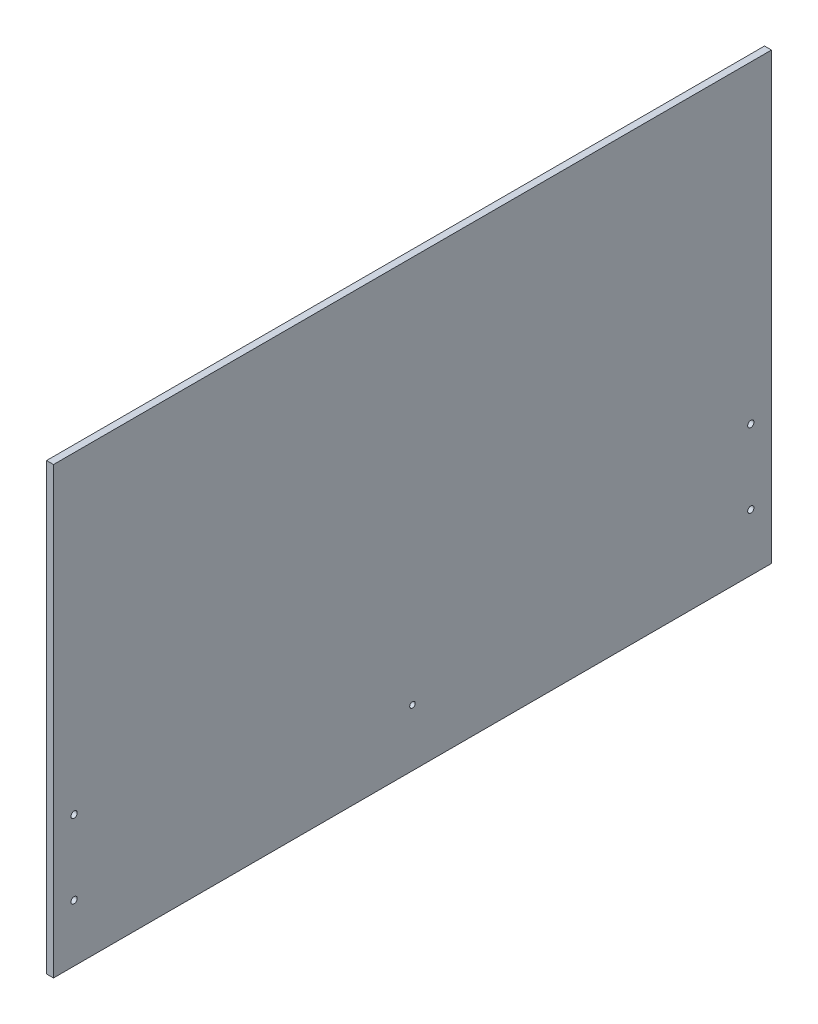
ISO-10303-21;
HEADER;
FILE_DESCRIPTION(('STEP AP214'),'2;1');
FILE_NAME('part.step','',(''),(''),'','','');
FILE_SCHEMA(('AUTOMOTIVE_DESIGN { 1 0 10303 214 1 1 1 1 }'));
ENDSEC;
DATA;
#1=APPLICATION_CONTEXT('core data for automotive mechanical design processes');
#2=APPLICATION_PROTOCOL_DEFINITION('international standard','automotive_design',2000,#1);
#3=PRODUCT_CONTEXT('',#1,'mechanical');
#4=PRODUCT('Part','Part','',(#3));
#5=PRODUCT_RELATED_PRODUCT_CATEGORY('part','',(#4));
#6=PRODUCT_DEFINITION_FORMATION('','',#4);
#7=PRODUCT_DEFINITION_CONTEXT('part definition',#1,'design');
#8=PRODUCT_DEFINITION('design','',#6,#7);
#9=PRODUCT_DEFINITION_SHAPE('','',#8);
#10=(LENGTH_UNIT() NAMED_UNIT(*) SI_UNIT(.MILLI.,.METRE.));
#11=(NAMED_UNIT(*) PLANE_ANGLE_UNIT() SI_UNIT($,.RADIAN.));
#12=(NAMED_UNIT(*) SI_UNIT($,.STERADIAN.) SOLID_ANGLE_UNIT());
#13=UNCERTAINTY_MEASURE_WITH_UNIT(LENGTH_MEASURE(1.E-05),#10,'distance_accuracy_value','');
#14=(GEOMETRIC_REPRESENTATION_CONTEXT(3) GLOBAL_UNCERTAINTY_ASSIGNED_CONTEXT((#13)) GLOBAL_UNIT_ASSIGNED_CONTEXT((#10,
#11,#12)) REPRESENTATION_CONTEXT('',''));
#15=CARTESIAN_POINT('',(0.,0.,0.));
#16=DIRECTION('',(0.,0.,1.));
#17=DIRECTION('',(1.,0.,0.));
#18=AXIS2_PLACEMENT_3D('',#15,#16,#17);
#19=CARTESIAN_POINT('',(4.7625,-152.4,-246.0625));
#20=DIRECTION('',(0.,0.,1.));
#21=DIRECTION('',(1.,0.,0.));
#22=AXIS2_PLACEMENT_3D('',#19,#20,#21);
#23=PLANE('',#22);
#24=DIRECTION('',(0.,1.,0.));
#25=VECTOR('',#24,1.);
#26=CARTESIAN_POINT('',(0.,-152.4,-246.0625));
#27=LINE('',#26,#25);
#28=CARTESIAN_POINT('',(0.,-152.4,-246.0625));
#29=VERTEX_POINT('',#28);
#30=CARTESIAN_POINT('',(0.,152.4,-246.0625));
#31=VERTEX_POINT('',#30);
#32=EDGE_CURVE('E99',#29,#31,#27,.T.);
#33=ORIENTED_EDGE('',*,*,#32,.T.);
#34=DIRECTION('',(-1.,0.,0.));
#35=VECTOR('',#34,1.);
#36=CARTESIAN_POINT('',(4.7625,152.4,-246.0625));
#37=LINE('',#36,#35);
#38=CARTESIAN_POINT('',(4.7625,152.4,-246.0625));
#39=VERTEX_POINT('',#38);
#40=EDGE_CURVE('E11',#39,#31,#37,.T.);
#41=ORIENTED_EDGE('',*,*,#40,.F.);
#42=DIRECTION('',(0.,1.,0.));
#43=VECTOR('',#42,1.);
#44=CARTESIAN_POINT('',(4.7625,-152.4,-246.0625));
#45=LINE('',#44,#43);
#46=CARTESIAN_POINT('',(4.7625,-152.4,-246.0625));
#47=VERTEX_POINT('',#46);
#48=EDGE_CURVE('E86',#47,#39,#45,.T.);
#49=ORIENTED_EDGE('',*,*,#48,.F.);
#50=DIRECTION('',(-1.,0.,0.));
#51=VECTOR('',#50,1.);
#52=CARTESIAN_POINT('',(4.7625,-152.4,-246.0625));
#53=LINE('',#52,#51);
#54=EDGE_CURVE('E95',#47,#29,#53,.T.);
#55=ORIENTED_EDGE('',*,*,#54,.T.);
#56=EDGE_LOOP('',(#33,#41,#49,#55));
#57=FACE_BOUND('',#56,.T.);
#58=ADVANCED_FACE('F33',(#57),#23,.F.);
#59=CARTESIAN_POINT('',(4.7625,152.4,246.0625));
#60=DIRECTION('',(0.,-1.,0.));
#61=DIRECTION('',(0.,0.,-1.));
#62=AXIS2_PLACEMENT_3D('',#59,#60,#61);
#63=PLANE('',#62);
#64=DIRECTION('',(0.,0.,1.));
#65=VECTOR('',#64,1.);
#66=CARTESIAN_POINT('',(0.,152.4,246.0625));
#67=LINE('',#66,#65);
#68=CARTESIAN_POINT('',(0.,152.4,246.0625));
#69=VERTEX_POINT('',#68);
#70=EDGE_CURVE('E90',#31,#69,#67,.T.);
#71=ORIENTED_EDGE('',*,*,#70,.T.);
#72=DIRECTION('',(-1.,0.,0.));
#73=VECTOR('',#72,1.);
#74=CARTESIAN_POINT('',(4.7625,152.4,246.0625));
#75=LINE('',#74,#73);
#76=CARTESIAN_POINT('',(4.7625,152.4,246.0625));
#77=VERTEX_POINT('',#76);
#78=EDGE_CURVE('E42',#77,#69,#75,.T.);
#79=ORIENTED_EDGE('',*,*,#78,.F.);
#80=DIRECTION('',(0.,0.,1.));
#81=VECTOR('',#80,1.);
#82=CARTESIAN_POINT('',(4.7625,152.4,246.0625));
#83=LINE('',#82,#81);
#84=EDGE_CURVE('E81',#39,#77,#83,.T.);
#85=ORIENTED_EDGE('',*,*,#84,.F.);
#86=ORIENTED_EDGE('',*,*,#40,.T.);
#87=EDGE_LOOP('',(#71,#79,#85,#86));
#88=FACE_BOUND('',#87,.T.);
#89=ADVANCED_FACE('F89',(#88),#63,.F.);
#90=CARTESIAN_POINT('',(4.7625,-152.4,246.0625));
#91=DIRECTION('',(0.,0.,-1.));
#92=DIRECTION('',(-1.,0.,0.));
#93=AXIS2_PLACEMENT_3D('',#90,#91,#92);
#94=PLANE('',#93);
#95=DIRECTION('',(0.,-1.,0.));
#96=VECTOR('',#95,1.);
#97=CARTESIAN_POINT('',(0.,-152.4,246.0625));
#98=LINE('',#97,#96);
#99=CARTESIAN_POINT('',(0.,-152.4,246.0625));
#100=VERTEX_POINT('',#99);
#101=EDGE_CURVE('E68',#69,#100,#98,.T.);
#102=ORIENTED_EDGE('',*,*,#101,.T.);
#103=DIRECTION('',(-1.,0.,0.));
#104=VECTOR('',#103,1.);
#105=CARTESIAN_POINT('',(4.7625,-152.4,246.0625));
#106=LINE('',#105,#104);
#107=CARTESIAN_POINT('',(4.7625,-152.4,246.0625));
#108=VERTEX_POINT('',#107);
#109=EDGE_CURVE('E91',#108,#100,#106,.T.);
#110=ORIENTED_EDGE('',*,*,#109,.F.);
#111=DIRECTION('',(0.,-1.,0.));
#112=VECTOR('',#111,1.);
#113=CARTESIAN_POINT('',(4.7625,-152.4,246.0625));
#114=LINE('',#113,#112);
#115=EDGE_CURVE('E84',#77,#108,#114,.T.);
#116=ORIENTED_EDGE('',*,*,#115,.F.);
#117=ORIENTED_EDGE('',*,*,#78,.T.);
#118=EDGE_LOOP('',(#102,#110,#116,#117));
#119=FACE_BOUND('',#118,.T.);
#120=ADVANCED_FACE('F93',(#119),#94,.F.);
#121=CARTESIAN_POINT('',(4.7625,-152.4,246.0625));
#122=DIRECTION('',(0.,1.,0.));
#123=DIRECTION('',(0.,0.,1.));
#124=AXIS2_PLACEMENT_3D('',#121,#122,#123);
#125=PLANE('',#124);
#126=DIRECTION('',(0.,0.,-1.));
#127=VECTOR('',#126,1.);
#128=CARTESIAN_POINT('',(0.,-152.4,246.0625));
#129=LINE('',#128,#127);
#130=EDGE_CURVE('E74',#100,#29,#129,.T.);
#131=ORIENTED_EDGE('',*,*,#130,.T.);
#132=ORIENTED_EDGE('',*,*,#54,.F.);
#133=DIRECTION('',(0.,0.,-1.));
#134=VECTOR('',#133,1.);
#135=CARTESIAN_POINT('',(4.7625,-152.4,246.0625));
#136=LINE('',#135,#134);
#137=EDGE_CURVE('E51',#108,#47,#136,.T.);
#138=ORIENTED_EDGE('',*,*,#137,.F.);
#139=ORIENTED_EDGE('',*,*,#109,.T.);
#140=EDGE_LOOP('',(#131,#132,#138,#139));
#141=FACE_BOUND('',#140,.T.);
#142=ADVANCED_FACE('F143',(#141),#125,.F.);
#143=CARTESIAN_POINT('',(4.7625,0.,0.));
#144=DIRECTION('',(-1.,0.,0.));
#145=DIRECTION('',(0.,0.,1.));
#146=AXIS2_PLACEMENT_3D('',#143,#144,#145);
#147=PLANE('',#146);
#148=CARTESIAN_POINT('',(4.7625,-113.284,0.));
#149=DIRECTION('',(1.,0.,0.));
#150=DIRECTION('',(0.,0.,-1.));
#151=AXIS2_PLACEMENT_3D('',#148,#149,#150);
#152=CIRCLE('',#151,1.89865);
#153=CARTESIAN_POINT('',(4.7625,-113.284,-1.89865000000006));
#154=VERTEX_POINT('',#153);
#155=EDGE_CURVE('E238',#154,#154,#152,.T.);
#156=ORIENTED_EDGE('',*,*,#155,.F.);
#157=EDGE_LOOP('',(#156));
#158=FACE_BOUND('',#157,.T.);
#159=CARTESIAN_POINT('',(4.7625,-113.284,231.93375));
#160=DIRECTION('',(1.,0.,0.));
#161=DIRECTION('',(0.,0.,-1.));
#162=AXIS2_PLACEMENT_3D('',#159,#160,#161);
#163=CIRCLE('',#162,2.15264999999999);
#164=CARTESIAN_POINT('',(4.7625,-113.284,229.7811));
#165=VERTEX_POINT('',#164);
#166=EDGE_CURVE('E124',#165,#165,#163,.T.);
#167=ORIENTED_EDGE('',*,*,#166,.F.);
#168=EDGE_LOOP('',(#167));
#169=FACE_BOUND('',#168,.T.);
#170=CARTESIAN_POINT('',(4.7625,-62.484,231.93375));
#171=DIRECTION('',(1.,0.,0.));
#172=DIRECTION('',(0.,0.,-1.));
#173=AXIS2_PLACEMENT_3D('',#170,#171,#172);
#174=CIRCLE('',#173,2.15264999999999);
#175=CARTESIAN_POINT('',(4.7625,-62.484,229.7811));
#176=VERTEX_POINT('',#175);
#177=EDGE_CURVE('E114',#176,#176,#174,.T.);
#178=ORIENTED_EDGE('',*,*,#177,.F.);
#179=EDGE_LOOP('',(#178));
#180=FACE_BOUND('',#179,.T.);
#181=CARTESIAN_POINT('',(4.7625,-62.484,-231.93375));
#182=DIRECTION('',(1.,0.,0.));
#183=DIRECTION('',(0.,0.,-1.));
#184=AXIS2_PLACEMENT_3D('',#181,#182,#183);
#185=CIRCLE('',#184,2.15264999999999);
#186=CARTESIAN_POINT('',(4.7625,-62.484,-234.0864));
#187=VERTEX_POINT('',#186);
#188=EDGE_CURVE('E111',#187,#187,#185,.T.);
#189=ORIENTED_EDGE('',*,*,#188,.F.);
#190=EDGE_LOOP('',(#189));
#191=FACE_BOUND('',#190,.T.);
#192=CARTESIAN_POINT('',(4.7625,-113.284,-231.93375));
#193=DIRECTION('',(1.,0.,0.));
#194=DIRECTION('',(0.,0.,-1.));
#195=AXIS2_PLACEMENT_3D('',#192,#193,#194);
#196=CIRCLE('',#195,2.15264999999999);
#197=CARTESIAN_POINT('',(4.7625,-113.284,-234.0864));
#198=VERTEX_POINT('',#197);
#199=EDGE_CURVE('E110',#198,#198,#196,.T.);
#200=ORIENTED_EDGE('',*,*,#199,.F.);
#201=EDGE_LOOP('',(#200));
#202=FACE_BOUND('',#201,.T.);
#203=ORIENTED_EDGE('',*,*,#48,.T.);
#204=ORIENTED_EDGE('',*,*,#84,.T.);
#205=ORIENTED_EDGE('',*,*,#115,.T.);
#206=ORIENTED_EDGE('',*,*,#137,.T.);
#207=EDGE_LOOP('',(#203,#204,#205,#206));
#208=FACE_BOUND('',#207,.T.);
#209=ADVANCED_FACE('F82',(#158,#169,#180,#191,#202,#208),#147,.F.);
#210=CARTESIAN_POINT('',(0.,0.,0.));
#211=DIRECTION('',(-1.,0.,0.));
#212=DIRECTION('',(0.,0.,1.));
#213=AXIS2_PLACEMENT_3D('',#210,#211,#212);
#214=PLANE('',#213);
#215=CARTESIAN_POINT('',(0.,-113.284,0.));
#216=DIRECTION('',(-1.,0.,0.));
#217=DIRECTION('',(0.,0.,1.));
#218=AXIS2_PLACEMENT_3D('',#215,#216,#217);
#219=CIRCLE('',#218,1.89865);
#220=CARTESIAN_POINT('',(0.,-113.284,1.89864999999995));
#221=VERTEX_POINT('',#220);
#222=EDGE_CURVE('E235',#221,#221,#219,.T.);
#223=ORIENTED_EDGE('',*,*,#222,.F.);
#224=EDGE_LOOP('',(#223));
#225=FACE_BOUND('',#224,.T.);
#226=CARTESIAN_POINT('',(0.,-113.284,231.93375));
#227=DIRECTION('',(-1.,0.,0.));
#228=DIRECTION('',(0.,0.,1.));
#229=AXIS2_PLACEMENT_3D('',#226,#227,#228);
#230=CIRCLE('',#229,2.15264999999999);
#231=CARTESIAN_POINT('',(0.,-113.284,234.0864));
#232=VERTEX_POINT('',#231);
#233=EDGE_CURVE('E36',#232,#232,#230,.T.);
#234=ORIENTED_EDGE('',*,*,#233,.F.);
#235=EDGE_LOOP('',(#234));
#236=FACE_BOUND('',#235,.T.);
#237=CARTESIAN_POINT('',(0.,-62.484,231.93375));
#238=DIRECTION('',(-1.,0.,0.));
#239=DIRECTION('',(0.,0.,1.));
#240=AXIS2_PLACEMENT_3D('',#237,#238,#239);
#241=CIRCLE('',#240,2.15264999999999);
#242=CARTESIAN_POINT('',(0.,-62.484,234.0864));
#243=VERTEX_POINT('',#242);
#244=EDGE_CURVE('E112',#243,#243,#241,.T.);
#245=ORIENTED_EDGE('',*,*,#244,.F.);
#246=EDGE_LOOP('',(#245));
#247=FACE_BOUND('',#246,.T.);
#248=CARTESIAN_POINT('',(0.,-62.484,-231.93375));
#249=DIRECTION('',(-1.,0.,0.));
#250=DIRECTION('',(0.,0.,1.));
#251=AXIS2_PLACEMENT_3D('',#248,#249,#250);
#252=CIRCLE('',#251,2.15264999999999);
#253=CARTESIAN_POINT('',(0.,-62.484,-229.7811));
#254=VERTEX_POINT('',#253);
#255=EDGE_CURVE('E108',#254,#254,#252,.T.);
#256=ORIENTED_EDGE('',*,*,#255,.F.);
#257=EDGE_LOOP('',(#256));
#258=FACE_BOUND('',#257,.T.);
#259=CARTESIAN_POINT('',(0.,-113.284,-231.93375));
#260=DIRECTION('',(-1.,0.,0.));
#261=DIRECTION('',(0.,0.,1.));
#262=AXIS2_PLACEMENT_3D('',#259,#260,#261);
#263=CIRCLE('',#262,2.15264999999999);
#264=CARTESIAN_POINT('',(0.,-113.284,-229.7811));
#265=VERTEX_POINT('',#264);
#266=EDGE_CURVE('E102',#265,#265,#263,.T.);
#267=ORIENTED_EDGE('',*,*,#266,.F.);
#268=EDGE_LOOP('',(#267));
#269=FACE_BOUND('',#268,.T.);
#270=ORIENTED_EDGE('',*,*,#32,.F.);
#271=ORIENTED_EDGE('',*,*,#130,.F.);
#272=ORIENTED_EDGE('',*,*,#101,.F.);
#273=ORIENTED_EDGE('',*,*,#70,.F.);
#274=EDGE_LOOP('',(#270,#271,#272,#273));
#275=FACE_BOUND('',#274,.T.);
#276=ADVANCED_FACE('F136',(#225,#236,#247,#258,#269,#275),#214,.T.);
#277=CARTESIAN_POINT('',(4.7625,-113.284,-231.93375));
#278=DIRECTION('',(1.,0.,0.));
#279=DIRECTION('',(0.,0.,-1.));
#280=AXIS2_PLACEMENT_3D('',#277,#278,#279);
#281=CYLINDRICAL_SURFACE('',#280,2.15264999999999);
#282=ORIENTED_EDGE('',*,*,#266,.T.);
#283=EDGE_LOOP('',(#282));
#284=FACE_BOUND('',#283,.T.);
#285=ORIENTED_EDGE('',*,*,#199,.T.);
#286=EDGE_LOOP('',(#285));
#287=FACE_BOUND('',#286,.T.);
#288=ADVANCED_FACE('F133',(#284,#287),#281,.F.);
#289=CARTESIAN_POINT('',(4.7625,-62.484,-231.93375));
#290=DIRECTION('',(1.,0.,0.));
#291=DIRECTION('',(0.,0.,-1.));
#292=AXIS2_PLACEMENT_3D('',#289,#290,#291);
#293=CYLINDRICAL_SURFACE('',#292,2.15264999999999);
#294=ORIENTED_EDGE('',*,*,#255,.T.);
#295=EDGE_LOOP('',(#294));
#296=FACE_BOUND('',#295,.T.);
#297=ORIENTED_EDGE('',*,*,#188,.T.);
#298=EDGE_LOOP('',(#297));
#299=FACE_BOUND('',#298,.T.);
#300=ADVANCED_FACE('F177',(#296,#299),#293,.F.);
#301=CARTESIAN_POINT('',(4.7625,-62.484,231.93375));
#302=DIRECTION('',(1.,0.,0.));
#303=DIRECTION('',(0.,0.,-1.));
#304=AXIS2_PLACEMENT_3D('',#301,#302,#303);
#305=CYLINDRICAL_SURFACE('',#304,2.15264999999999);
#306=ORIENTED_EDGE('',*,*,#244,.T.);
#307=EDGE_LOOP('',(#306));
#308=FACE_BOUND('',#307,.T.);
#309=ORIENTED_EDGE('',*,*,#177,.T.);
#310=EDGE_LOOP('',(#309));
#311=FACE_BOUND('',#310,.T.);
#312=ADVANCED_FACE('F187',(#308,#311),#305,.F.);
#313=CARTESIAN_POINT('',(4.7625,-113.284,231.93375));
#314=DIRECTION('',(1.,0.,0.));
#315=DIRECTION('',(0.,0.,-1.));
#316=AXIS2_PLACEMENT_3D('',#313,#314,#315);
#317=CYLINDRICAL_SURFACE('',#316,2.15264999999999);
#318=ORIENTED_EDGE('',*,*,#233,.T.);
#319=EDGE_LOOP('',(#318));
#320=FACE_BOUND('',#319,.T.);
#321=ORIENTED_EDGE('',*,*,#166,.T.);
#322=EDGE_LOOP('',(#321));
#323=FACE_BOUND('',#322,.T.);
#324=ADVANCED_FACE('F197',(#320,#323),#317,.F.);
#325=CARTESIAN_POINT('',(4.7625,-113.284,0.));
#326=DIRECTION('',(1.,0.,0.));
#327=DIRECTION('',(0.,0.,-1.));
#328=AXIS2_PLACEMENT_3D('',#325,#326,#327);
#329=CYLINDRICAL_SURFACE('',#328,1.89865);
#330=ORIENTED_EDGE('',*,*,#222,.T.);
#331=EDGE_LOOP('',(#330));
#332=FACE_BOUND('',#331,.T.);
#333=ORIENTED_EDGE('',*,*,#155,.T.);
#334=EDGE_LOOP('',(#333));
#335=FACE_BOUND('',#334,.T.);
#336=ADVANCED_FACE('F206',(#332,#335),#329,.F.);
#337=CLOSED_SHELL('',(#58,#89,#120,#142,#209,#276,#288,#300,#312,#324,#336));
#338=MANIFOLD_SOLID_BREP('B2',#337);
#339=ADVANCED_BREP_SHAPE_REPRESENTATION('',(#18,#338),#14);
#340=SHAPE_DEFINITION_REPRESENTATION(#9,#339);
ENDSEC;
END-ISO-10303-21;
